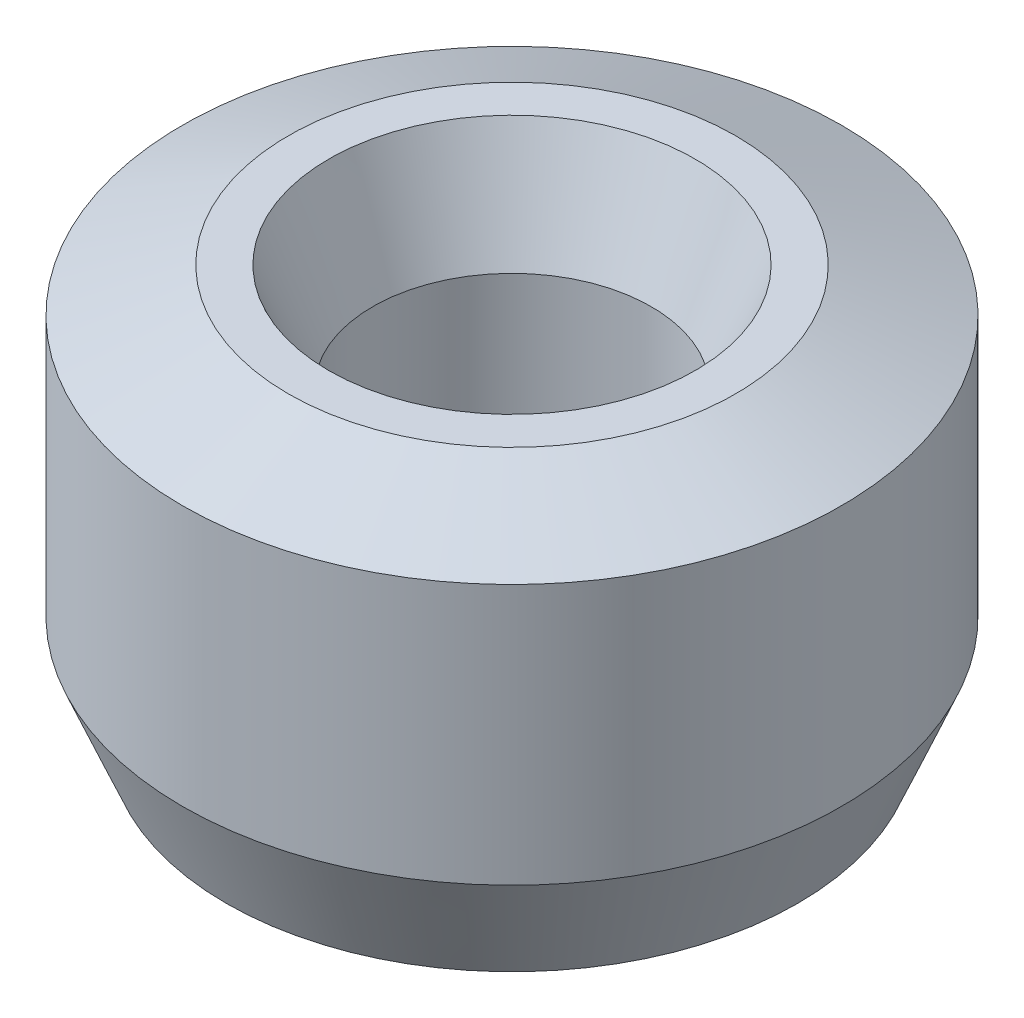
ISO-10303-21;
HEADER;
FILE_DESCRIPTION(('STEP AP214'),'2;1');
FILE_NAME('part.step','',(''),(''),'','','');
FILE_SCHEMA(('AUTOMOTIVE_DESIGN { 1 0 10303 214 1 1 1 1 }'));
ENDSEC;
DATA;
#1=APPLICATION_CONTEXT('core data for automotive mechanical design processes');
#2=APPLICATION_PROTOCOL_DEFINITION('international standard','automotive_design',2000,#1);
#3=PRODUCT_CONTEXT('',#1,'mechanical');
#4=PRODUCT('Part','Part','',(#3));
#5=PRODUCT_RELATED_PRODUCT_CATEGORY('part','',(#4));
#6=PRODUCT_DEFINITION_FORMATION('','',#4);
#7=PRODUCT_DEFINITION_CONTEXT('part definition',#1,'design');
#8=PRODUCT_DEFINITION('design','',#6,#7);
#9=PRODUCT_DEFINITION_SHAPE('','',#8);
#10=(LENGTH_UNIT() NAMED_UNIT(*) SI_UNIT(.MILLI.,.METRE.));
#11=(NAMED_UNIT(*) PLANE_ANGLE_UNIT() SI_UNIT($,.RADIAN.));
#12=(NAMED_UNIT(*) SI_UNIT($,.STERADIAN.) SOLID_ANGLE_UNIT());
#13=UNCERTAINTY_MEASURE_WITH_UNIT(LENGTH_MEASURE(1.E-05),#10,'distance_accuracy_value','');
#14=(GEOMETRIC_REPRESENTATION_CONTEXT(3) GLOBAL_UNCERTAINTY_ASSIGNED_CONTEXT((#13)) GLOBAL_UNIT_ASSIGNED_CONTEXT((#10,
#11,#12)) REPRESENTATION_CONTEXT('',''));
#15=CARTESIAN_POINT('',(0.,0.,0.));
#16=DIRECTION('',(0.,0.,1.));
#17=DIRECTION('',(1.,0.,0.));
#18=AXIS2_PLACEMENT_3D('',#15,#16,#17);
#19=CARTESIAN_POINT('',(0.,31.119095223489,0.));
#20=DIRECTION('',(0.,-1.,0.));
#21=DIRECTION('',(0.,0.,-1.));
#22=AXIS2_PLACEMENT_3D('',#19,#20,#21);
#23=CYLINDRICAL_SURFACE('',#22,25.);
#24=CARTESIAN_POINT('',(0.,8.03607693149626,0.));
#25=DIRECTION('',(0.,1.,0.));
#26=DIRECTION('',(0.,0.,1.));
#27=AXIS2_PLACEMENT_3D('',#24,#25,#26);
#28=CIRCLE('',#27,25.);
#29=CARTESIAN_POINT('',(0.,8.03607693149626,25.));
#30=VERTEX_POINT('',#29);
#31=EDGE_CURVE('E10',#30,#30,#28,.T.);
#32=ORIENTED_EDGE('',*,*,#31,.T.);
#33=EDGE_LOOP('',(#32));
#34=FACE_BOUND('',#33,.T.);
#35=CARTESIAN_POINT('',(0.,27.7921607967247,0.));
#36=DIRECTION('',(0.,1.,0.));
#37=DIRECTION('',(0.,0.,1.));
#38=AXIS2_PLACEMENT_3D('',#35,#36,#37);
#39=CIRCLE('',#38,25.);
#40=CARTESIAN_POINT('',(0.,27.7921607967247,25.));
#41=VERTEX_POINT('',#40);
#42=EDGE_CURVE('E50',#41,#41,#39,.F.);
#43=ORIENTED_EDGE('',*,*,#42,.T.);
#44=EDGE_LOOP('',(#43));
#45=FACE_BOUND('',#44,.T.);
#46=ADVANCED_FACE('F39',(#34,#45),#23,.T.);
#47=CARTESIAN_POINT('',(0.,31.119095223489,0.));
#48=DIRECTION('',(0.,1.,0.));
#49=DIRECTION('',(0.,0.,1.));
#50=AXIS2_PLACEMENT_3D('',#47,#48,#49);
#51=PLANE('',#50);
#52=CARTESIAN_POINT('',(0.,31.119095223489,0.));
#53=DIRECTION('',(0.,1.,0.));
#54=DIRECTION('',(0.,0.,1.));
#55=AXIS2_PLACEMENT_3D('',#52,#53,#54);
#56=CIRCLE('',#55,13.8993588879093);
#57=CARTESIAN_POINT('',(0.,31.119095223489,13.8993588879093));
#58=VERTEX_POINT('',#57);
#59=EDGE_CURVE('E58',#58,#58,#56,.F.);
#60=ORIENTED_EDGE('',*,*,#59,.T.);
#61=EDGE_LOOP('',(#60));
#62=FACE_BOUND('',#61,.T.);
#63=CARTESIAN_POINT('',(0.,31.119095223489,0.));
#64=DIRECTION('',(0.,1.,0.));
#65=DIRECTION('',(0.,0.,1.));
#66=AXIS2_PLACEMENT_3D('',#63,#64,#65);
#67=CIRCLE('',#66,16.9639230685037);
#68=CARTESIAN_POINT('',(0.,31.119095223489,16.9639230685037));
#69=VERTEX_POINT('',#68);
#70=EDGE_CURVE('E61',#69,#69,#67,.T.);
#71=ORIENTED_EDGE('',*,*,#70,.T.);
#72=EDGE_LOOP('',(#71));
#73=FACE_BOUND('',#72,.T.);
#74=ADVANCED_FACE('F88',(#62,#73),#51,.T.);
#75=CARTESIAN_POINT('',(0.,0.,0.));
#76=DIRECTION('',(0.,1.,0.));
#77=DIRECTION('',(0.,0.,1.));
#78=AXIS2_PLACEMENT_3D('',#75,#76,#77);
#79=PLANE('',#78);
#80=CARTESIAN_POINT('',(0.,0.,0.));
#81=DIRECTION('',(0.,1.,0.));
#82=DIRECTION('',(0.,0.,1.));
#83=AXIS2_PLACEMENT_3D('',#80,#81,#82);
#84=CIRCLE('',#83,18.6085013926413);
#85=CARTESIAN_POINT('',(0.,0.,18.6085013926413));
#86=VERTEX_POINT('',#85);
#87=EDGE_CURVE('E51',#86,#86,#84,.T.);
#88=ORIENTED_EDGE('',*,*,#87,.T.);
#89=EDGE_LOOP('',(#88));
#90=FACE_BOUND('',#89,.T.);
#91=CARTESIAN_POINT('',(0.,0.,0.));
#92=DIRECTION('',(0.,1.,0.));
#93=DIRECTION('',(0.,0.,1.));
#94=AXIS2_PLACEMENT_3D('',#91,#92,#93);
#95=CIRCLE('',#94,21.6730655732357);
#96=CARTESIAN_POINT('',(0.,0.,21.6730655732357));
#97=VERTEX_POINT('',#96);
#98=EDGE_CURVE('E54',#97,#97,#95,.F.);
#99=ORIENTED_EDGE('',*,*,#98,.T.);
#100=EDGE_LOOP('',(#99));
#101=FACE_BOUND('',#100,.T.);
#102=ADVANCED_FACE('F83',(#90,#101),#79,.F.);
#103=CARTESIAN_POINT('',(0.,31.119095223489,0.));
#104=DIRECTION('',(0.,-1.,0.));
#105=DIRECTION('',(0.,0.,-1.));
#106=AXIS2_PLACEMENT_3D('',#103,#104,#105);
#107=CYLINDRICAL_SURFACE('',#106,10.5724244611451);
#108=CARTESIAN_POINT('',(0.,23.0830182919928,0.));
#109=DIRECTION('',(0.,1.,0.));
#110=DIRECTION('',(0.,0.,1.));
#111=AXIS2_PLACEMENT_3D('',#108,#109,#110);
#112=CIRCLE('',#111,10.5724244611451);
#113=CARTESIAN_POINT('',(0.,23.0830182919928,10.5724244611451));
#114=VERTEX_POINT('',#113);
#115=EDGE_CURVE('E67',#114,#114,#112,.T.);
#116=ORIENTED_EDGE('',*,*,#115,.T.);
#117=EDGE_LOOP('',(#116));
#118=FACE_BOUND('',#117,.T.);
#119=CARTESIAN_POINT('',(0.,3.32693442676425,0.));
#120=DIRECTION('',(0.,1.,0.));
#121=DIRECTION('',(0.,0.,1.));
#122=AXIS2_PLACEMENT_3D('',#119,#120,#121);
#123=CIRCLE('',#122,10.5724244611451);
#124=CARTESIAN_POINT('',(0.,3.32693442676425,10.5724244611451));
#125=VERTEX_POINT('',#124);
#126=EDGE_CURVE('E69',#125,#125,#123,.F.);
#127=ORIENTED_EDGE('',*,*,#126,.T.);
#128=EDGE_LOOP('',(#127));
#129=FACE_BOUND('',#128,.T.);
#130=ADVANCED_FACE('F71',(#118,#129),#107,.F.);
#131=CARTESIAN_POINT('',(0.,23.0830182919928,0.));
#132=DIRECTION('',(0.,1.,0.));
#133=DIRECTION('',(0.,0.,1.));
#134=AXIS2_PLACEMENT_3D('',#131,#132,#133);
#135=CONICAL_SURFACE('',#134,10.5724244611451,0.392516629894566);
#136=ORIENTED_EDGE('',*,*,#59,.F.);
#137=EDGE_LOOP('',(#136));
#138=FACE_BOUND('',#137,.T.);
#139=ORIENTED_EDGE('',*,*,#115,.F.);
#140=EDGE_LOOP('',(#139));
#141=FACE_BOUND('',#140,.T.);
#142=ADVANCED_FACE('F77',(#138,#141),#135,.F.);
#143=CARTESIAN_POINT('',(0.,0.,0.));
#144=DIRECTION('',(0.,-1.,0.));
#145=DIRECTION('',(0.,0.,-1.));
#146=AXIS2_PLACEMENT_3D('',#143,#144,#145);
#147=CONICAL_SURFACE('',#146,18.6085013926413,1.17827969690033);
#148=ORIENTED_EDGE('',*,*,#126,.F.);
#149=EDGE_LOOP('',(#148));
#150=FACE_BOUND('',#149,.T.);
#151=ORIENTED_EDGE('',*,*,#87,.F.);
#152=EDGE_LOOP('',(#151));
#153=FACE_BOUND('',#152,.T.);
#154=ADVANCED_FACE('F73',(#150,#153),#147,.F.);
#155=CARTESIAN_POINT('',(0.,8.03607693149626,0.));
#156=DIRECTION('',(0.,1.,0.));
#157=DIRECTION('',(0.,0.,1.));
#158=AXIS2_PLACEMENT_3D('',#155,#156,#157);
#159=CONICAL_SURFACE('',#158,25.,0.392516629894566);
#160=ORIENTED_EDGE('',*,*,#98,.F.);
#161=EDGE_LOOP('',(#160));
#162=FACE_BOUND('',#161,.T.);
#163=ORIENTED_EDGE('',*,*,#31,.F.);
#164=EDGE_LOOP('',(#163));
#165=FACE_BOUND('',#164,.T.);
#166=ADVANCED_FACE('F76',(#162,#165),#159,.T.);
#167=CARTESIAN_POINT('',(0.,31.119095223489,0.));
#168=DIRECTION('',(0.,-1.,0.));
#169=DIRECTION('',(0.,0.,-1.));
#170=AXIS2_PLACEMENT_3D('',#167,#168,#169);
#171=CONICAL_SURFACE('',#170,16.9639230685037,1.17827969690033);
#172=ORIENTED_EDGE('',*,*,#42,.F.);
#173=EDGE_LOOP('',(#172));
#174=FACE_BOUND('',#173,.T.);
#175=ORIENTED_EDGE('',*,*,#70,.F.);
#176=EDGE_LOOP('',(#175));
#177=FACE_BOUND('',#176,.T.);
#178=ADVANCED_FACE('F45',(#174,#177),#171,.T.);
#179=CLOSED_SHELL('',(#46,#74,#102,#130,#142,#154,#166,#178));
#180=MANIFOLD_SOLID_BREP('B2',#179);
#181=ADVANCED_BREP_SHAPE_REPRESENTATION('',(#18,#180),#14);
#182=SHAPE_DEFINITION_REPRESENTATION(#9,#181);
ENDSEC;
END-ISO-10303-21;
